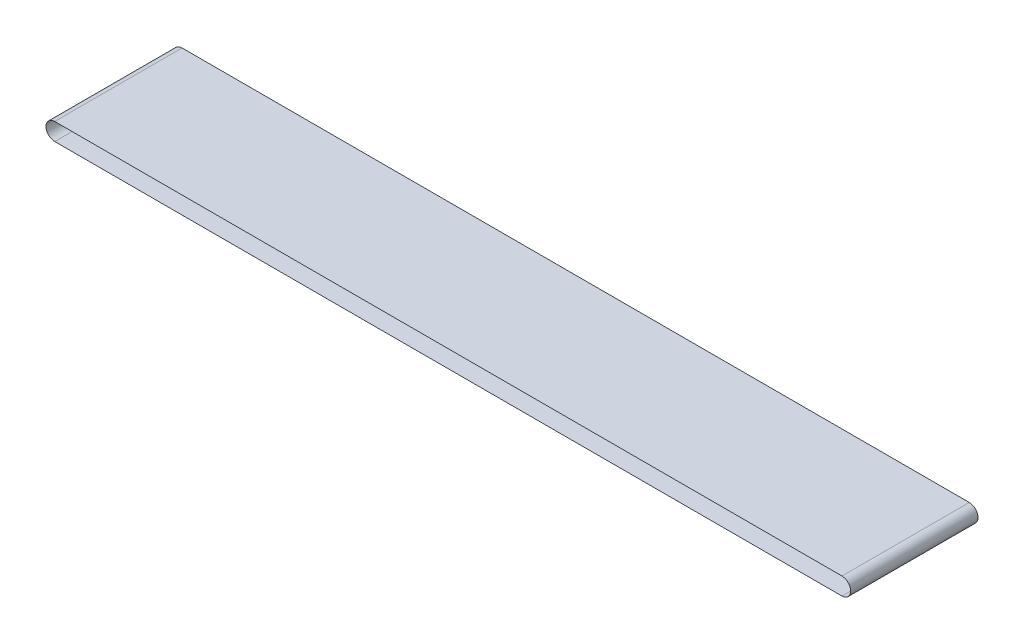
ISO-10303-21;
HEADER;
FILE_DESCRIPTION(('STEP AP214'),'2;1');
FILE_NAME('part.step','',(''),(''),'','','');
FILE_SCHEMA(('AUTOMOTIVE_DESIGN { 1 0 10303 214 1 1 1 1 }'));
ENDSEC;
DATA;
#1=APPLICATION_CONTEXT('core data for automotive mechanical design processes');
#2=APPLICATION_PROTOCOL_DEFINITION('international standard','automotive_design',2000,#1);
#3=PRODUCT_CONTEXT('',#1,'mechanical');
#4=PRODUCT('Part','Part','',(#3));
#5=PRODUCT_RELATED_PRODUCT_CATEGORY('part','',(#4));
#6=PRODUCT_DEFINITION_FORMATION('','',#4);
#7=PRODUCT_DEFINITION_CONTEXT('part definition',#1,'design');
#8=PRODUCT_DEFINITION('design','',#6,#7);
#9=PRODUCT_DEFINITION_SHAPE('','',#8);
#10=(LENGTH_UNIT() NAMED_UNIT(*) SI_UNIT(.MILLI.,.METRE.));
#11=(NAMED_UNIT(*) PLANE_ANGLE_UNIT() SI_UNIT($,.RADIAN.));
#12=(NAMED_UNIT(*) SI_UNIT($,.STERADIAN.) SOLID_ANGLE_UNIT());
#13=UNCERTAINTY_MEASURE_WITH_UNIT(LENGTH_MEASURE(1.E-05),#10,'distance_accuracy_value','');
#14=(GEOMETRIC_REPRESENTATION_CONTEXT(3) GLOBAL_UNCERTAINTY_ASSIGNED_CONTEXT((#13)) GLOBAL_UNIT_ASSIGNED_CONTEXT((#10,
#11,#12)) REPRESENTATION_CONTEXT('',''));
#15=CARTESIAN_POINT('',(0.,0.,0.));
#16=DIRECTION('',(0.,0.,1.));
#17=DIRECTION('',(1.,0.,0.));
#18=AXIS2_PLACEMENT_3D('',#15,#16,#17);
#19=CARTESIAN_POINT('',(-3124.73968240224,12.5,550.));
#20=DIRECTION('',(0.,0.,-1.));
#21=DIRECTION('',(-1.,0.,0.));
#22=AXIS2_PLACEMENT_3D('',#19,#20,#21);
#23=CYLINDRICAL_SURFACE('',#22,37.5);
#24=CARTESIAN_POINT('',(-3124.73968240224,12.5,0.));
#25=DIRECTION('',(0.,0.,1.));
#26=DIRECTION('',(1.,0.,0.));
#27=AXIS2_PLACEMENT_3D('',#24,#25,#26);
#28=CIRCLE('',#27,37.5);
#29=CARTESIAN_POINT('',(-3124.73968240224,50.,0.));
#30=VERTEX_POINT('',#29);
#31=CARTESIAN_POINT('',(-3124.73968240224,-25.,0.));
#32=VERTEX_POINT('',#31);
#33=EDGE_CURVE('E147',#30,#32,#28,.T.);
#34=ORIENTED_EDGE('',*,*,#33,.T.);
#35=DIRECTION('',(0.,0.,-1.));
#36=VECTOR('',#35,1.);
#37=CARTESIAN_POINT('',(-3124.73968240224,-25.,550.));
#38=LINE('',#37,#36);
#39=CARTESIAN_POINT('',(-3124.73968240224,-25.,550.));
#40=VERTEX_POINT('',#39);
#41=EDGE_CURVE('E11',#40,#32,#38,.T.);
#42=ORIENTED_EDGE('',*,*,#41,.F.);
#43=CARTESIAN_POINT('',(-3124.73968240224,12.5,550.));
#44=DIRECTION('',(0.,0.,1.));
#45=DIRECTION('',(1.,0.,0.));
#46=AXIS2_PLACEMENT_3D('',#43,#44,#45);
#47=CIRCLE('',#46,37.5);
#48=CARTESIAN_POINT('',(-3124.73968240224,50.,550.));
#49=VERTEX_POINT('',#48);
#50=EDGE_CURVE('E136',#49,#40,#47,.T.);
#51=ORIENTED_EDGE('',*,*,#50,.F.);
#52=DIRECTION('',(0.,0.,-1.));
#53=VECTOR('',#52,1.);
#54=CARTESIAN_POINT('',(-3124.73968240224,50.,550.));
#55=LINE('',#54,#53);
#56=EDGE_CURVE('E146',#49,#30,#55,.T.);
#57=ORIENTED_EDGE('',*,*,#56,.T.);
#58=EDGE_LOOP('',(#34,#42,#51,#57));
#59=FACE_BOUND('',#58,.T.);
#60=ADVANCED_FACE('F39',(#59),#23,.T.);
#61=CARTESIAN_POINT('',(-3124.73968240224,-25.,550.));
#62=DIRECTION('',(0.,1.,0.));
#63=DIRECTION('',(-1.,0.,0.));
#64=AXIS2_PLACEMENT_3D('',#61,#62,#63);
#65=PLANE('',#64);
#66=DIRECTION('',(1.,0.,0.));
#67=VECTOR('',#66,1.);
#68=CARTESIAN_POINT('',(-3124.73968240224,-25.,0.));
#69=LINE('',#68,#67);
#70=CARTESIAN_POINT('',(275.260317597758,-24.9999999999999,0.));
#71=VERTEX_POINT('',#70);
#72=EDGE_CURVE('E150',#32,#71,#69,.T.);
#73=ORIENTED_EDGE('',*,*,#72,.T.);
#74=DIRECTION('',(0.,0.,-1.));
#75=VECTOR('',#74,1.);
#76=CARTESIAN_POINT('',(275.260317597758,-24.9999999999999,550.));
#77=LINE('',#76,#75);
#78=CARTESIAN_POINT('',(275.260317597758,-24.9999999999999,550.));
#79=VERTEX_POINT('',#78);
#80=EDGE_CURVE('E46',#79,#71,#77,.T.);
#81=ORIENTED_EDGE('',*,*,#80,.F.);
#82=DIRECTION('',(1.,0.,0.));
#83=VECTOR('',#82,1.);
#84=CARTESIAN_POINT('',(-3124.73968240224,-25.,550.));
#85=LINE('',#84,#83);
#86=EDGE_CURVE('E139',#40,#79,#85,.T.);
#87=ORIENTED_EDGE('',*,*,#86,.F.);
#88=ORIENTED_EDGE('',*,*,#41,.T.);
#89=EDGE_LOOP('',(#73,#81,#87,#88));
#90=FACE_BOUND('',#89,.T.);
#91=ADVANCED_FACE('F178',(#90),#65,.F.);
#92=CARTESIAN_POINT('',(275.260317597758,12.5,550.));
#93=DIRECTION('',(0.,0.,-1.));
#94=DIRECTION('',(-1.,0.,0.));
#95=AXIS2_PLACEMENT_3D('',#92,#93,#94);
#96=CYLINDRICAL_SURFACE('',#95,37.4999999999999);
#97=CARTESIAN_POINT('',(275.260317597758,12.5,0.));
#98=DIRECTION('',(0.,0.,1.));
#99=DIRECTION('',(1.,0.,0.));
#100=AXIS2_PLACEMENT_3D('',#97,#98,#99);
#101=CIRCLE('',#100,37.4999999999999);
#102=CARTESIAN_POINT('',(275.260317597757,50.,0.));
#103=VERTEX_POINT('',#102);
#104=EDGE_CURVE('E152',#71,#103,#101,.T.);
#105=ORIENTED_EDGE('',*,*,#104,.T.);
#106=DIRECTION('',(0.,0.,-1.));
#107=VECTOR('',#106,1.);
#108=CARTESIAN_POINT('',(275.260317597757,50.,550.));
#109=LINE('',#108,#107);
#110=CARTESIAN_POINT('',(275.260317597757,50.,550.));
#111=VERTEX_POINT('',#110);
#112=EDGE_CURVE('E157',#111,#103,#109,.T.);
#113=ORIENTED_EDGE('',*,*,#112,.F.);
#114=CARTESIAN_POINT('',(275.260317597758,12.5,550.));
#115=DIRECTION('',(0.,0.,1.));
#116=DIRECTION('',(1.,0.,0.));
#117=AXIS2_PLACEMENT_3D('',#114,#115,#116);
#118=CIRCLE('',#117,37.4999999999999);
#119=EDGE_CURVE('E142',#79,#111,#118,.T.);
#120=ORIENTED_EDGE('',*,*,#119,.F.);
#121=ORIENTED_EDGE('',*,*,#80,.T.);
#122=EDGE_LOOP('',(#105,#113,#120,#121));
#123=FACE_BOUND('',#122,.T.);
#124=ADVANCED_FACE('F164',(#123),#96,.T.);
#125=CARTESIAN_POINT('',(-3124.73968240224,50.,550.));
#126=DIRECTION('',(0.,-1.,0.));
#127=DIRECTION('',(1.,0.,0.));
#128=AXIS2_PLACEMENT_3D('',#125,#126,#127);
#129=PLANE('',#128);
#130=DIRECTION('',(-1.,0.,0.));
#131=VECTOR('',#130,1.);
#132=CARTESIAN_POINT('',(-3124.73968240224,50.,0.));
#133=LINE('',#132,#131);
#134=EDGE_CURVE('E140',#103,#30,#133,.T.);
#135=ORIENTED_EDGE('',*,*,#134,.T.);
#136=ORIENTED_EDGE('',*,*,#56,.F.);
#137=DIRECTION('',(-1.,0.,0.));
#138=VECTOR('',#137,1.);
#139=CARTESIAN_POINT('',(-3124.73968240224,50.,550.));
#140=LINE('',#139,#138);
#141=EDGE_CURVE('E144',#111,#49,#140,.T.);
#142=ORIENTED_EDGE('',*,*,#141,.F.);
#143=ORIENTED_EDGE('',*,*,#112,.T.);
#144=EDGE_LOOP('',(#135,#136,#142,#143));
#145=FACE_BOUND('',#144,.T.);
#146=ADVANCED_FACE('F171',(#145),#129,.F.);
#147=CARTESIAN_POINT('',(-3124.73968240224,12.5,550.));
#148=DIRECTION('',(0.,0.,1.));
#149=DIRECTION('',(1.,0.,0.));
#150=AXIS2_PLACEMENT_3D('',#147,#148,#149);
#151=PLANE('',#150);
#152=CARTESIAN_POINT('',(-3124.73968240224,12.5,550.));
#153=DIRECTION('',(0.,0.,1.));
#154=DIRECTION('',(1.,0.,0.));
#155=AXIS2_PLACEMENT_3D('',#152,#153,#154);
#156=CIRCLE('',#155,37.498);
#157=CARTESIAN_POINT('',(-3124.73968240224,49.998,550.));
#158=VERTEX_POINT('',#157);
#159=CARTESIAN_POINT('',(-3124.73968240224,-24.998,550.));
#160=VERTEX_POINT('',#159);
#161=EDGE_CURVE('E124',#158,#160,#156,.T.);
#162=ORIENTED_EDGE('',*,*,#161,.F.);
#163=DIRECTION('',(-1.,0.,0.));
#164=VECTOR('',#163,1.);
#165=CARTESIAN_POINT('',(-3124.73968240224,49.998,550.));
#166=LINE('',#165,#164);
#167=CARTESIAN_POINT('',(275.260317597757,49.9979999999999,550.));
#168=VERTEX_POINT('',#167);
#169=EDGE_CURVE('E108',#168,#158,#166,.T.);
#170=ORIENTED_EDGE('',*,*,#169,.F.);
#171=CARTESIAN_POINT('',(275.260317597758,12.5,550.));
#172=DIRECTION('',(0.,0.,1.));
#173=DIRECTION('',(1.,0.,0.));
#174=AXIS2_PLACEMENT_3D('',#171,#172,#173);
#175=CIRCLE('',#174,37.4979999999999);
#176=CARTESIAN_POINT('',(275.260317597758,-24.9979999999998,550.));
#177=VERTEX_POINT('',#176);
#178=EDGE_CURVE('E133',#177,#168,#175,.T.);
#179=ORIENTED_EDGE('',*,*,#178,.F.);
#180=DIRECTION('',(1.,0.,0.));
#181=VECTOR('',#180,1.);
#182=CARTESIAN_POINT('',(-3124.73968240224,-24.998,550.));
#183=LINE('',#182,#181);
#184=EDGE_CURVE('E126',#160,#177,#183,.T.);
#185=ORIENTED_EDGE('',*,*,#184,.F.);
#186=EDGE_LOOP('',(#162,#170,#179,#185));
#187=FACE_BOUND('',#186,.T.);
#188=ORIENTED_EDGE('',*,*,#50,.T.);
#189=ORIENTED_EDGE('',*,*,#86,.T.);
#190=ORIENTED_EDGE('',*,*,#119,.T.);
#191=ORIENTED_EDGE('',*,*,#141,.T.);
#192=EDGE_LOOP('',(#188,#189,#190,#191));
#193=FACE_BOUND('',#192,.T.);
#194=ADVANCED_FACE('F177',(#187,#193),#151,.T.);
#195=CARTESIAN_POINT('',(-3124.73968240224,12.5,0.));
#196=DIRECTION('',(0.,0.,1.));
#197=DIRECTION('',(1.,0.,0.));
#198=AXIS2_PLACEMENT_3D('',#195,#196,#197);
#199=PLANE('',#198);
#200=DIRECTION('',(-1.,0.,0.));
#201=VECTOR('',#200,1.);
#202=CARTESIAN_POINT('',(-3124.73968240224,49.998,0.));
#203=LINE('',#202,#201);
#204=CARTESIAN_POINT('',(275.260317597757,49.9979999999999,0.));
#205=VERTEX_POINT('',#204);
#206=CARTESIAN_POINT('',(-3124.73968240224,49.998,0.));
#207=VERTEX_POINT('',#206);
#208=EDGE_CURVE('E106',#205,#207,#203,.T.);
#209=ORIENTED_EDGE('',*,*,#208,.T.);
#210=CARTESIAN_POINT('',(-3124.73968240224,12.5,0.));
#211=DIRECTION('',(0.,0.,1.));
#212=DIRECTION('',(1.,0.,0.));
#213=AXIS2_PLACEMENT_3D('',#210,#211,#212);
#214=CIRCLE('',#213,37.498);
#215=CARTESIAN_POINT('',(-3124.73968240224,-24.998,0.));
#216=VERTEX_POINT('',#215);
#217=EDGE_CURVE('E114',#207,#216,#214,.T.);
#218=ORIENTED_EDGE('',*,*,#217,.T.);
#219=DIRECTION('',(1.,0.,0.));
#220=VECTOR('',#219,1.);
#221=CARTESIAN_POINT('',(-3124.73968240224,-24.998,0.));
#222=LINE('',#221,#220);
#223=CARTESIAN_POINT('',(275.260317597758,-24.9979999999998,0.));
#224=VERTEX_POINT('',#223);
#225=EDGE_CURVE('E120',#216,#224,#222,.T.);
#226=ORIENTED_EDGE('',*,*,#225,.T.);
#227=CARTESIAN_POINT('',(275.260317597758,12.5,0.));
#228=DIRECTION('',(0.,0.,1.));
#229=DIRECTION('',(1.,0.,0.));
#230=AXIS2_PLACEMENT_3D('',#227,#228,#229);
#231=CIRCLE('',#230,37.4979999999999);
#232=EDGE_CURVE('E60',#224,#205,#231,.T.);
#233=ORIENTED_EDGE('',*,*,#232,.T.);
#234=EDGE_LOOP('',(#209,#218,#226,#233));
#235=FACE_BOUND('',#234,.T.);
#236=ORIENTED_EDGE('',*,*,#33,.F.);
#237=ORIENTED_EDGE('',*,*,#134,.F.);
#238=ORIENTED_EDGE('',*,*,#104,.F.);
#239=ORIENTED_EDGE('',*,*,#72,.F.);
#240=EDGE_LOOP('',(#236,#237,#238,#239));
#241=FACE_BOUND('',#240,.T.);
#242=ADVANCED_FACE('F122',(#235,#241),#199,.F.);
#243=CARTESIAN_POINT('',(-3124.73968240224,12.5,550.));
#244=DIRECTION('',(0.,0.,-1.));
#245=DIRECTION('',(-1.,0.,0.));
#246=AXIS2_PLACEMENT_3D('',#243,#244,#245);
#247=CYLINDRICAL_SURFACE('',#246,37.498);
#248=ORIENTED_EDGE('',*,*,#217,.F.);
#249=DIRECTION('',(0.,0.,-1.));
#250=VECTOR('',#249,1.);
#251=CARTESIAN_POINT('',(-3124.73968240224,49.998,550.));
#252=LINE('',#251,#250);
#253=EDGE_CURVE('E102',#158,#207,#252,.T.);
#254=ORIENTED_EDGE('',*,*,#253,.F.);
#255=ORIENTED_EDGE('',*,*,#161,.T.);
#256=DIRECTION('',(0.,0.,1.));
#257=VECTOR('',#256,1.);
#258=CARTESIAN_POINT('',(-3124.73968240224,-24.998,550.));
#259=LINE('',#258,#257);
#260=EDGE_CURVE('E117',#160,#216,#259,.F.);
#261=ORIENTED_EDGE('',*,*,#260,.T.);
#262=EDGE_LOOP('',(#248,#254,#255,#261));
#263=FACE_BOUND('',#262,.T.);
#264=ADVANCED_FACE('F115',(#263),#247,.F.);
#265=CARTESIAN_POINT('',(-3124.73968240224,-24.998,550.));
#266=DIRECTION('',(0.,1.,0.));
#267=DIRECTION('',(-1.,0.,0.));
#268=AXIS2_PLACEMENT_3D('',#265,#266,#267);
#269=PLANE('',#268);
#270=ORIENTED_EDGE('',*,*,#225,.F.);
#271=ORIENTED_EDGE('',*,*,#260,.F.);
#272=ORIENTED_EDGE('',*,*,#184,.T.);
#273=DIRECTION('',(0.,0.,-1.));
#274=VECTOR('',#273,1.);
#275=CARTESIAN_POINT('',(275.260317597758,-24.9979999999999,550.));
#276=LINE('',#275,#274);
#277=EDGE_CURVE('E262',#177,#224,#276,.T.);
#278=ORIENTED_EDGE('',*,*,#277,.T.);
#279=EDGE_LOOP('',(#270,#271,#272,#278));
#280=FACE_BOUND('',#279,.T.);
#281=ADVANCED_FACE('F198',(#280),#269,.T.);
#282=CARTESIAN_POINT('',(275.260317597758,12.5,550.));
#283=DIRECTION('',(0.,0.,-1.));
#284=DIRECTION('',(-1.,0.,0.));
#285=AXIS2_PLACEMENT_3D('',#282,#283,#284);
#286=CYLINDRICAL_SURFACE('',#285,37.4979999999999);
#287=ORIENTED_EDGE('',*,*,#232,.F.);
#288=ORIENTED_EDGE('',*,*,#277,.F.);
#289=ORIENTED_EDGE('',*,*,#178,.T.);
#290=DIRECTION('',(0.,0.,1.));
#291=VECTOR('',#290,1.);
#292=CARTESIAN_POINT('',(275.260317597757,49.998,550.));
#293=LINE('',#292,#291);
#294=EDGE_CURVE('E53',#168,#205,#293,.F.);
#295=ORIENTED_EDGE('',*,*,#294,.T.);
#296=EDGE_LOOP('',(#287,#288,#289,#295));
#297=FACE_BOUND('',#296,.T.);
#298=ADVANCED_FACE('F195',(#297),#286,.F.);
#299=CARTESIAN_POINT('',(-3124.73968240224,49.998,550.));
#300=DIRECTION('',(0.,-1.,0.));
#301=DIRECTION('',(1.,0.,0.));
#302=AXIS2_PLACEMENT_3D('',#299,#300,#301);
#303=PLANE('',#302);
#304=ORIENTED_EDGE('',*,*,#208,.F.);
#305=ORIENTED_EDGE('',*,*,#294,.F.);
#306=ORIENTED_EDGE('',*,*,#169,.T.);
#307=ORIENTED_EDGE('',*,*,#253,.T.);
#308=EDGE_LOOP('',(#304,#305,#306,#307));
#309=FACE_BOUND('',#308,.T.);
#310=ADVANCED_FACE('F104',(#309),#303,.T.);
#311=CLOSED_SHELL('',(#60,#91,#124,#146,#194,#242,#264,#281,#298,#310));
#312=MANIFOLD_SOLID_BREP('B2',#311);
#313=ADVANCED_BREP_SHAPE_REPRESENTATION('',(#18,#312),#14);
#314=SHAPE_DEFINITION_REPRESENTATION(#9,#313);
ENDSEC;
END-ISO-10303-21;
